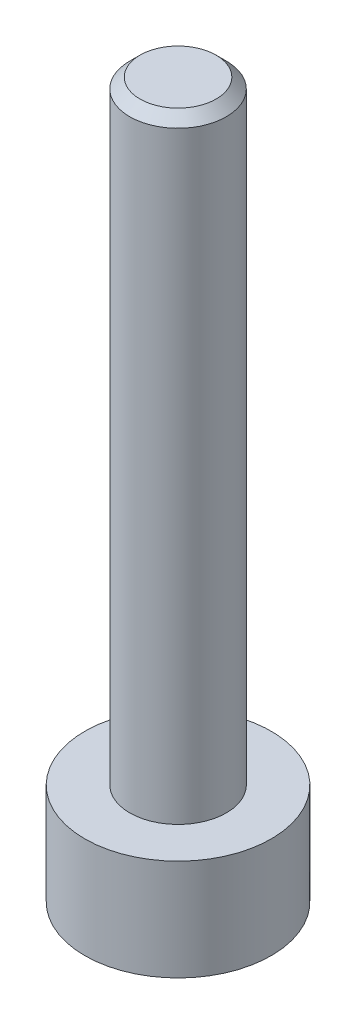
ISO-10303-21;
HEADER;
FILE_DESCRIPTION(('STEP AP214'),'2;1');
FILE_NAME('part.step','',(''),(''),'','','');
FILE_SCHEMA(('AUTOMOTIVE_DESIGN { 1 0 10303 214 1 1 1 1 }'));
ENDSEC;
DATA;
#1=APPLICATION_CONTEXT('core data for automotive mechanical design processes');
#2=APPLICATION_PROTOCOL_DEFINITION('international standard','automotive_design',2000,#1);
#3=PRODUCT_CONTEXT('',#1,'mechanical');
#4=PRODUCT('Part','Part','',(#3));
#5=PRODUCT_RELATED_PRODUCT_CATEGORY('part','',(#4));
#6=PRODUCT_DEFINITION_FORMATION('','',#4);
#7=PRODUCT_DEFINITION_CONTEXT('part definition',#1,'design');
#8=PRODUCT_DEFINITION('design','',#6,#7);
#9=PRODUCT_DEFINITION_SHAPE('','',#8);
#10=(LENGTH_UNIT() NAMED_UNIT(*) SI_UNIT(.MILLI.,.METRE.));
#11=(NAMED_UNIT(*) PLANE_ANGLE_UNIT() SI_UNIT($,.RADIAN.));
#12=(NAMED_UNIT(*) SI_UNIT($,.STERADIAN.) SOLID_ANGLE_UNIT());
#13=UNCERTAINTY_MEASURE_WITH_UNIT(LENGTH_MEASURE(1.E-05),#10,'distance_accuracy_value','');
#14=(GEOMETRIC_REPRESENTATION_CONTEXT(3) GLOBAL_UNCERTAINTY_ASSIGNED_CONTEXT((#13)) GLOBAL_UNIT_ASSIGNED_CONTEXT((#10,
#11,#12)) REPRESENTATION_CONTEXT('',''));
#15=CARTESIAN_POINT('',(0.,0.,0.));
#16=DIRECTION('',(0.,0.,1.));
#17=DIRECTION('',(1.,0.,0.));
#18=AXIS2_PLACEMENT_3D('',#15,#16,#17);
#19=CARTESIAN_POINT('',(0.,1.98,0.));
#20=DIRECTION('',(0.,-1.,0.));
#21=DIRECTION('',(0.,0.,-1.));
#22=AXIS2_PLACEMENT_3D('',#19,#20,#21);
#23=CYLINDRICAL_SURFACE('',#22,1.825);
#24=CARTESIAN_POINT('',(0.,1.98,0.));
#25=DIRECTION('',(0.,1.,0.));
#26=DIRECTION('',(0.,0.,1.));
#27=AXIS2_PLACEMENT_3D('',#24,#25,#26);
#28=CIRCLE('',#27,1.825);
#29=CARTESIAN_POINT('',(0.,1.98,1.825));
#30=VERTEX_POINT('',#29);
#31=EDGE_CURVE('E177',#30,#30,#28,.T.);
#32=ORIENTED_EDGE('',*,*,#31,.F.);
#33=EDGE_LOOP('',(#32));
#34=FACE_BOUND('',#33,.T.);
#35=CARTESIAN_POINT('',(0.,0.,0.));
#36=DIRECTION('',(0.,1.,0.));
#37=DIRECTION('',(0.,0.,1.));
#38=AXIS2_PLACEMENT_3D('',#35,#36,#37);
#39=CIRCLE('',#38,1.825);
#40=CARTESIAN_POINT('',(0.,0.,1.825));
#41=VERTEX_POINT('',#40);
#42=EDGE_CURVE('E163',#41,#41,#39,.T.);
#43=ORIENTED_EDGE('',*,*,#42,.T.);
#44=EDGE_LOOP('',(#43));
#45=FACE_BOUND('',#44,.T.);
#46=ADVANCED_FACE('F47',(#34,#45),#23,.T.);
#47=CARTESIAN_POINT('',(0.,1.98,0.));
#48=DIRECTION('',(0.,1.,0.));
#49=DIRECTION('',(0.,0.,1.));
#50=AXIS2_PLACEMENT_3D('',#47,#48,#49);
#51=PLANE('',#50);
#52=CARTESIAN_POINT('',(0.,1.98,0.));
#53=DIRECTION('',(0.,1.,0.));
#54=DIRECTION('',(0.,0.,1.));
#55=AXIS2_PLACEMENT_3D('',#52,#53,#54);
#56=CIRCLE('',#55,0.945);
#57=CARTESIAN_POINT('',(0.,1.98,0.945));
#58=VERTEX_POINT('',#57);
#59=EDGE_CURVE('E173',#58,#58,#56,.T.);
#60=ORIENTED_EDGE('',*,*,#59,.F.);
#61=EDGE_LOOP('',(#60));
#62=FACE_BOUND('',#61,.T.);
#63=ORIENTED_EDGE('',*,*,#31,.T.);
#64=EDGE_LOOP('',(#63));
#65=FACE_BOUND('',#64,.T.);
#66=ADVANCED_FACE('F199',(#62,#65),#51,.T.);
#67=CARTESIAN_POINT('',(0.,0.,0.));
#68=DIRECTION('',(0.,1.,0.));
#69=DIRECTION('',(0.,0.,1.));
#70=AXIS2_PLACEMENT_3D('',#67,#68,#69);
#71=PLANE('',#70);
#72=DIRECTION('',(0.5,0.,0.866025403784439));
#73=VECTOR('',#72,1.);
#74=CARTESIAN_POINT('',(0.458993464005752,0.,-0.795));
#75=LINE('',#74,#73);
#76=CARTESIAN_POINT('',(0.458993464005752,0.,-0.795));
#77=VERTEX_POINT('',#76);
#78=CARTESIAN_POINT('',(0.917986928011505,0.,0.));
#79=VERTEX_POINT('',#78);
#80=EDGE_CURVE('E144',#77,#79,#75,.T.);
#81=ORIENTED_EDGE('',*,*,#80,.F.);
#82=DIRECTION('',(1.,0.,0.));
#83=VECTOR('',#82,1.);
#84=CARTESIAN_POINT('',(-0.458993464005752,0.,-0.795));
#85=LINE('',#84,#83);
#86=CARTESIAN_POINT('',(-0.458993464005752,0.,-0.795));
#87=VERTEX_POINT('',#86);
#88=EDGE_CURVE('E64',#87,#77,#85,.T.);
#89=ORIENTED_EDGE('',*,*,#88,.F.);
#90=DIRECTION('',(0.5,0.,-0.866025403784439));
#91=VECTOR('',#90,1.);
#92=CARTESIAN_POINT('',(-0.917986928011505,0.,0.));
#93=LINE('',#92,#91);
#94=CARTESIAN_POINT('',(-0.917986928011505,0.,0.));
#95=VERTEX_POINT('',#94);
#96=EDGE_CURVE('E157',#95,#87,#93,.T.);
#97=ORIENTED_EDGE('',*,*,#96,.F.);
#98=DIRECTION('',(-0.5,0.,-0.866025403784439));
#99=VECTOR('',#98,1.);
#100=CARTESIAN_POINT('',(-0.458993464005753,0.,0.795));
#101=LINE('',#100,#99);
#102=CARTESIAN_POINT('',(-0.458993464005753,0.,0.795));
#103=VERTEX_POINT('',#102);
#104=EDGE_CURVE('E154',#103,#95,#101,.T.);
#105=ORIENTED_EDGE('',*,*,#104,.F.);
#106=DIRECTION('',(-1.,0.,0.));
#107=VECTOR('',#106,1.);
#108=CARTESIAN_POINT('',(0.458993464005752,0.,0.795));
#109=LINE('',#108,#107);
#110=CARTESIAN_POINT('',(0.458993464005752,0.,0.795));
#111=VERTEX_POINT('',#110);
#112=EDGE_CURVE('E112',#111,#103,#109,.T.);
#113=ORIENTED_EDGE('',*,*,#112,.F.);
#114=DIRECTION('',(-0.5,0.,0.866025403784438));
#115=VECTOR('',#114,1.);
#116=CARTESIAN_POINT('',(0.917986928011505,0.,0.));
#117=LINE('',#116,#115);
#118=EDGE_CURVE('E148',#79,#111,#117,.T.);
#119=ORIENTED_EDGE('',*,*,#118,.F.);
#120=EDGE_LOOP('',(#81,#89,#97,#105,#113,#119));
#121=FACE_BOUND('',#120,.T.);
#122=ORIENTED_EDGE('',*,*,#42,.F.);
#123=EDGE_LOOP('',(#122));
#124=FACE_BOUND('',#123,.T.);
#125=ADVANCED_FACE('F204',(#121,#124),#71,.F.);
#126=CARTESIAN_POINT('',(0.,13.98,0.));
#127=DIRECTION('',(0.,-1.,0.));
#128=DIRECTION('',(0.,0.,-1.));
#129=AXIS2_PLACEMENT_3D('',#126,#127,#128);
#130=CYLINDRICAL_SURFACE('',#129,0.945);
#131=CARTESIAN_POINT('',(0.,13.78,0.));
#132=DIRECTION('',(0.,1.,0.));
#133=DIRECTION('',(0.,0.,1.));
#134=AXIS2_PLACEMENT_3D('',#131,#132,#133);
#135=CIRCLE('',#134,0.945);
#136=CARTESIAN_POINT('',(0.,13.78,0.945));
#137=VERTEX_POINT('',#136);
#138=EDGE_CURVE('E11',#137,#137,#135,.F.);
#139=ORIENTED_EDGE('',*,*,#138,.T.);
#140=EDGE_LOOP('',(#139));
#141=FACE_BOUND('',#140,.T.);
#142=ORIENTED_EDGE('',*,*,#59,.T.);
#143=EDGE_LOOP('',(#142));
#144=FACE_BOUND('',#143,.T.);
#145=ADVANCED_FACE('F211',(#141,#144),#130,.T.);
#146=CARTESIAN_POINT('',(0.,13.98,0.));
#147=DIRECTION('',(0.,1.,0.));
#148=DIRECTION('',(0.,0.,1.));
#149=AXIS2_PLACEMENT_3D('',#146,#147,#148);
#150=PLANE('',#149);
#151=CARTESIAN_POINT('',(0.,13.98,0.));
#152=DIRECTION('',(0.,1.,0.));
#153=DIRECTION('',(0.,0.,1.));
#154=AXIS2_PLACEMENT_3D('',#151,#152,#153);
#155=CIRCLE('',#154,0.744999999999996);
#156=CARTESIAN_POINT('',(0.,13.98,0.744999999999996));
#157=VERTEX_POINT('',#156);
#158=EDGE_CURVE('E57',#157,#157,#155,.T.);
#159=ORIENTED_EDGE('',*,*,#158,.T.);
#160=EDGE_LOOP('',(#159));
#161=FACE_BOUND('',#160,.T.);
#162=ADVANCED_FACE('F187',(#161),#150,.T.);
#163=CARTESIAN_POINT('',(-0.458993464005752,1.,-0.795));
#164=DIRECTION('',(0.,0.,-1.));
#165=DIRECTION('',(-1.,0.,0.));
#166=AXIS2_PLACEMENT_3D('',#163,#164,#165);
#167=PLANE('',#166);
#168=ORIENTED_EDGE('',*,*,#88,.T.);
#169=DIRECTION('',(0.,-1.,0.));
#170=VECTOR('',#169,1.);
#171=CARTESIAN_POINT('',(0.458993464005752,1.,-0.795));
#172=LINE('',#171,#170);
#173=CARTESIAN_POINT('',(0.458993464005752,1.,-0.795));
#174=VERTEX_POINT('',#173);
#175=EDGE_CURVE('E94',#174,#77,#172,.T.);
#176=ORIENTED_EDGE('',*,*,#175,.F.);
#177=DIRECTION('',(1.,0.,0.));
#178=VECTOR('',#177,1.);
#179=CARTESIAN_POINT('',(-0.458993464005752,1.,-0.795));
#180=LINE('',#179,#178);
#181=CARTESIAN_POINT('',(-0.458993464005752,1.,-0.795));
#182=VERTEX_POINT('',#181);
#183=EDGE_CURVE('E160',#182,#174,#180,.T.);
#184=ORIENTED_EDGE('',*,*,#183,.F.);
#185=DIRECTION('',(0.,-1.,0.));
#186=VECTOR('',#185,1.);
#187=CARTESIAN_POINT('',(-0.458993464005752,1.,-0.795));
#188=LINE('',#187,#186);
#189=EDGE_CURVE('E72',#182,#87,#188,.T.);
#190=ORIENTED_EDGE('',*,*,#189,.T.);
#191=EDGE_LOOP('',(#168,#176,#184,#190));
#192=FACE_BOUND('',#191,.T.);
#193=ADVANCED_FACE('F218',(#192),#167,.F.);
#194=CARTESIAN_POINT('',(-0.917986928011505,1.,0.));
#195=DIRECTION('',(-0.866025403784439,0.,-0.5));
#196=DIRECTION('',(-0.5,0.,0.866025403784439));
#197=AXIS2_PLACEMENT_3D('',#194,#195,#196);
#198=PLANE('',#197);
#199=ORIENTED_EDGE('',*,*,#96,.T.);
#200=ORIENTED_EDGE('',*,*,#189,.F.);
#201=DIRECTION('',(0.5,0.,-0.866025403784439));
#202=VECTOR('',#201,1.);
#203=CARTESIAN_POINT('',(-0.917986928011505,1.,0.));
#204=LINE('',#203,#202);
#205=CARTESIAN_POINT('',(-0.917986928011505,1.,0.));
#206=VERTEX_POINT('',#205);
#207=EDGE_CURVE('E126',#206,#182,#204,.T.);
#208=ORIENTED_EDGE('',*,*,#207,.F.);
#209=DIRECTION('',(0.,-1.,0.));
#210=VECTOR('',#209,1.);
#211=CARTESIAN_POINT('',(-0.917986928011505,1.,0.));
#212=LINE('',#211,#210);
#213=EDGE_CURVE('E117',#206,#95,#212,.T.);
#214=ORIENTED_EDGE('',*,*,#213,.T.);
#215=EDGE_LOOP('',(#199,#200,#208,#214));
#216=FACE_BOUND('',#215,.T.);
#217=ADVANCED_FACE('F221',(#216),#198,.F.);
#218=CARTESIAN_POINT('',(-0.458993464005753,1.,0.795));
#219=DIRECTION('',(-0.866025403784439,0.,0.5));
#220=DIRECTION('',(0.5,0.,0.866025403784439));
#221=AXIS2_PLACEMENT_3D('',#218,#219,#220);
#222=PLANE('',#221);
#223=ORIENTED_EDGE('',*,*,#104,.T.);
#224=ORIENTED_EDGE('',*,*,#213,.F.);
#225=DIRECTION('',(-0.5,0.,-0.866025403784439));
#226=VECTOR('',#225,1.);
#227=CARTESIAN_POINT('',(-0.458993464005753,1.,0.795));
#228=LINE('',#227,#226);
#229=CARTESIAN_POINT('',(-0.458993464005753,1.,0.795));
#230=VERTEX_POINT('',#229);
#231=EDGE_CURVE('E121',#230,#206,#228,.T.);
#232=ORIENTED_EDGE('',*,*,#231,.F.);
#233=DIRECTION('',(0.,-1.,0.));
#234=VECTOR('',#233,1.);
#235=CARTESIAN_POINT('',(-0.458993464005753,1.,0.795));
#236=LINE('',#235,#234);
#237=EDGE_CURVE('E105',#230,#103,#236,.T.);
#238=ORIENTED_EDGE('',*,*,#237,.T.);
#239=EDGE_LOOP('',(#223,#224,#232,#238));
#240=FACE_BOUND('',#239,.T.);
#241=ADVANCED_FACE('F122',(#240),#222,.F.);
#242=CARTESIAN_POINT('',(0.458993464005752,1.,0.795));
#243=DIRECTION('',(0.,0.,1.));
#244=DIRECTION('',(1.,0.,0.));
#245=AXIS2_PLACEMENT_3D('',#242,#243,#244);
#246=PLANE('',#245);
#247=ORIENTED_EDGE('',*,*,#112,.T.);
#248=ORIENTED_EDGE('',*,*,#237,.F.);
#249=DIRECTION('',(-1.,0.,0.));
#250=VECTOR('',#249,1.);
#251=CARTESIAN_POINT('',(0.458993464005752,1.,0.795));
#252=LINE('',#251,#250);
#253=CARTESIAN_POINT('',(0.458993464005752,1.,0.795));
#254=VERTEX_POINT('',#253);
#255=EDGE_CURVE('E109',#254,#230,#252,.T.);
#256=ORIENTED_EDGE('',*,*,#255,.F.);
#257=DIRECTION('',(0.,-1.,0.));
#258=VECTOR('',#257,1.);
#259=CARTESIAN_POINT('',(0.458993464005752,1.,0.795));
#260=LINE('',#259,#258);
#261=EDGE_CURVE('E118',#254,#111,#260,.T.);
#262=ORIENTED_EDGE('',*,*,#261,.T.);
#263=EDGE_LOOP('',(#247,#248,#256,#262));
#264=FACE_BOUND('',#263,.T.);
#265=ADVANCED_FACE('F107',(#264),#246,.F.);
#266=CARTESIAN_POINT('',(0.917986928011505,1.,0.));
#267=DIRECTION('',(0.866025403784438,0.,0.5));
#268=DIRECTION('',(0.5,0.,-0.866025403784439));
#269=AXIS2_PLACEMENT_3D('',#266,#267,#268);
#270=PLANE('',#269);
#271=ORIENTED_EDGE('',*,*,#118,.T.);
#272=ORIENTED_EDGE('',*,*,#261,.F.);
#273=DIRECTION('',(-0.5,0.,0.866025403784438));
#274=VECTOR('',#273,1.);
#275=CARTESIAN_POINT('',(0.917986928011505,1.,0.));
#276=LINE('',#275,#274);
#277=CARTESIAN_POINT('',(0.917986928011505,1.,0.));
#278=VERTEX_POINT('',#277);
#279=EDGE_CURVE('E132',#278,#254,#276,.T.);
#280=ORIENTED_EDGE('',*,*,#279,.F.);
#281=DIRECTION('',(0.,-1.,0.));
#282=VECTOR('',#281,1.);
#283=CARTESIAN_POINT('',(0.917986928011505,1.,0.));
#284=LINE('',#283,#282);
#285=EDGE_CURVE('E168',#278,#79,#284,.T.);
#286=ORIENTED_EDGE('',*,*,#285,.T.);
#287=EDGE_LOOP('',(#271,#272,#280,#286));
#288=FACE_BOUND('',#287,.T.);
#289=ADVANCED_FACE('F224',(#288),#270,.F.);
#290=CARTESIAN_POINT('',(0.458993464005752,1.,-0.795));
#291=DIRECTION('',(0.866025403784439,0.,-0.5));
#292=DIRECTION('',(-0.5,0.,-0.866025403784439));
#293=AXIS2_PLACEMENT_3D('',#290,#291,#292);
#294=PLANE('',#293);
#295=ORIENTED_EDGE('',*,*,#80,.T.);
#296=ORIENTED_EDGE('',*,*,#285,.F.);
#297=DIRECTION('',(0.5,0.,0.866025403784439));
#298=VECTOR('',#297,1.);
#299=CARTESIAN_POINT('',(0.458993464005752,1.,-0.795));
#300=LINE('',#299,#298);
#301=EDGE_CURVE('E136',#174,#278,#300,.T.);
#302=ORIENTED_EDGE('',*,*,#301,.F.);
#303=ORIENTED_EDGE('',*,*,#175,.T.);
#304=EDGE_LOOP('',(#295,#296,#302,#303));
#305=FACE_BOUND('',#304,.T.);
#306=ADVANCED_FACE('F195',(#305),#294,.F.);
#307=CARTESIAN_POINT('',(0.,1.,0.));
#308=DIRECTION('',(0.,-1.,0.));
#309=DIRECTION('',(0.,0.,-1.));
#310=AXIS2_PLACEMENT_3D('',#307,#308,#309);
#311=PLANE('',#310);
#312=ORIENTED_EDGE('',*,*,#183,.T.);
#313=ORIENTED_EDGE('',*,*,#301,.T.);
#314=ORIENTED_EDGE('',*,*,#279,.T.);
#315=ORIENTED_EDGE('',*,*,#255,.T.);
#316=ORIENTED_EDGE('',*,*,#231,.T.);
#317=ORIENTED_EDGE('',*,*,#207,.T.);
#318=EDGE_LOOP('',(#312,#313,#314,#315,#316,#317));
#319=FACE_BOUND('',#318,.T.);
#320=ADVANCED_FACE('F129',(#319),#311,.T.);
#321=CARTESIAN_POINT('',(0.,13.98,0.));
#322=DIRECTION('',(0.,-1.,0.));
#323=DIRECTION('',(0.,0.,-1.));
#324=AXIS2_PLACEMENT_3D('',#321,#322,#323);
#325=CONICAL_SURFACE('',#324,0.744999999999996,0.785398163397449);
#326=ORIENTED_EDGE('',*,*,#138,.F.);
#327=EDGE_LOOP('',(#326));
#328=FACE_BOUND('',#327,.T.);
#329=ORIENTED_EDGE('',*,*,#158,.F.);
#330=EDGE_LOOP('',(#329));
#331=FACE_BOUND('',#330,.T.);
#332=ADVANCED_FACE('F50',(#328,#331),#325,.T.);
#333=CLOSED_SHELL('',(#46,#66,#125,#145,#162,#193,#217,#241,#265,#289,#306,#320,#332));
#334=MANIFOLD_SOLID_BREP('B2',#333);
#335=ADVANCED_BREP_SHAPE_REPRESENTATION('',(#18,#334),#14);
#336=SHAPE_DEFINITION_REPRESENTATION(#9,#335);
ENDSEC;
END-ISO-10303-21;
